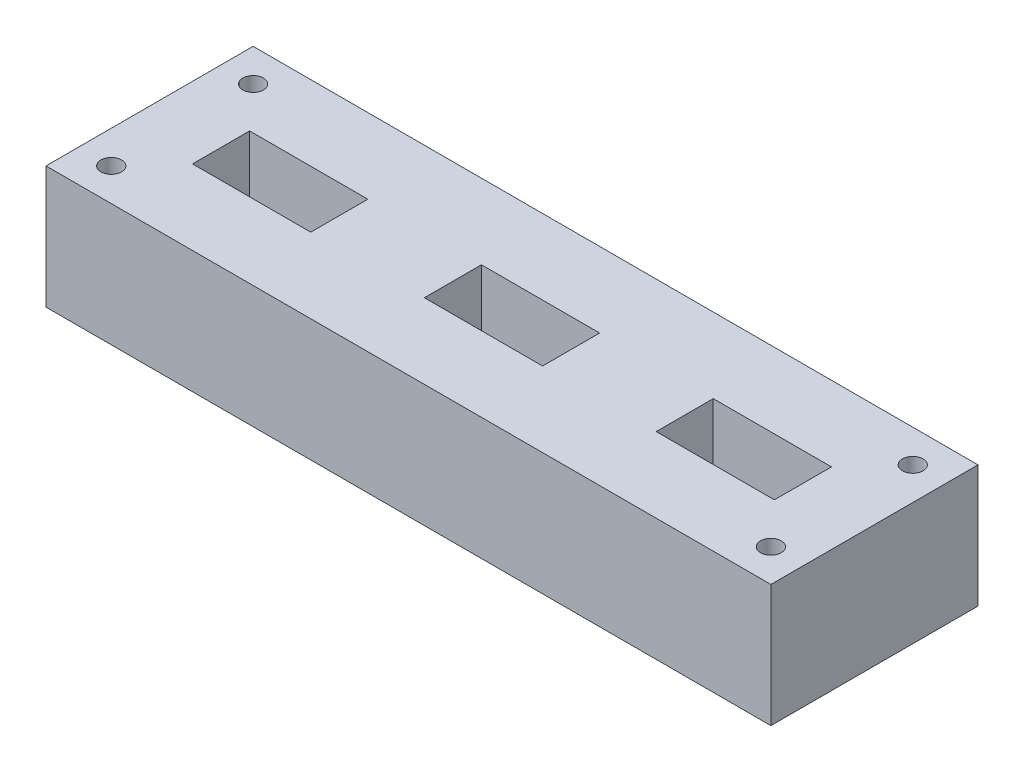
ISO-10303-21;
HEADER;
FILE_DESCRIPTION(('STEP AP214'),'2;1');
FILE_NAME('part.step','',(''),(''),'','','');
FILE_SCHEMA(('AUTOMOTIVE_DESIGN { 1 0 10303 214 1 1 1 1 }'));
ENDSEC;
DATA;
#1=APPLICATION_CONTEXT('core data for automotive mechanical design processes');
#2=APPLICATION_PROTOCOL_DEFINITION('international standard','automotive_design',2000,#1);
#3=PRODUCT_CONTEXT('',#1,'mechanical');
#4=PRODUCT('Part','Part','',(#3));
#5=PRODUCT_RELATED_PRODUCT_CATEGORY('part','',(#4));
#6=PRODUCT_DEFINITION_FORMATION('','',#4);
#7=PRODUCT_DEFINITION_CONTEXT('part definition',#1,'design');
#8=PRODUCT_DEFINITION('design','',#6,#7);
#9=PRODUCT_DEFINITION_SHAPE('','',#8);
#10=(LENGTH_UNIT() NAMED_UNIT(*) SI_UNIT(.MILLI.,.METRE.));
#11=(NAMED_UNIT(*) PLANE_ANGLE_UNIT() SI_UNIT($,.RADIAN.));
#12=(NAMED_UNIT(*) SI_UNIT($,.STERADIAN.) SOLID_ANGLE_UNIT());
#13=UNCERTAINTY_MEASURE_WITH_UNIT(LENGTH_MEASURE(1.E-05),#10,'distance_accuracy_value','');
#14=(GEOMETRIC_REPRESENTATION_CONTEXT(3) GLOBAL_UNCERTAINTY_ASSIGNED_CONTEXT((#13)) GLOBAL_UNIT_ASSIGNED_CONTEXT((#10,
#11,#12)) REPRESENTATION_CONTEXT('',''));
#15=CARTESIAN_POINT('',(0.,0.,0.));
#16=DIRECTION('',(0.,0.,1.));
#17=DIRECTION('',(1.,0.,0.));
#18=AXIS2_PLACEMENT_3D('',#15,#16,#17);
#19=CARTESIAN_POINT('',(-44.45,14.999999972,-12.7));
#20=DIRECTION('',(1.,0.,0.));
#21=DIRECTION('',(0.,0.,-1.));
#22=AXIS2_PLACEMENT_3D('',#19,#20,#21);
#23=PLANE('',#22);
#24=DIRECTION('',(0.,0.,1.));
#25=VECTOR('',#24,1.);
#26=CARTESIAN_POINT('',(-44.45,0.,-12.7));
#27=LINE('',#26,#25);
#28=CARTESIAN_POINT('',(-44.45,0.,-12.7));
#29=VERTEX_POINT('',#28);
#30=CARTESIAN_POINT('',(-44.45,0.,12.7));
#31=VERTEX_POINT('',#30);
#32=EDGE_CURVE('E211',#29,#31,#27,.T.);
#33=ORIENTED_EDGE('',*,*,#32,.T.);
#34=DIRECTION('',(0.,-1.,0.));
#35=VECTOR('',#34,1.);
#36=CARTESIAN_POINT('',(-44.45,14.999999972,12.7));
#37=LINE('',#36,#35);
#38=CARTESIAN_POINT('',(-44.45,14.999999972,12.7));
#39=VERTEX_POINT('',#38);
#40=EDGE_CURVE('E244',#39,#31,#37,.T.);
#41=ORIENTED_EDGE('',*,*,#40,.F.);
#42=DIRECTION('',(0.,0.,1.));
#43=VECTOR('',#42,1.);
#44=CARTESIAN_POINT('',(-44.45,14.999999972,-12.7));
#45=LINE('',#44,#43);
#46=CARTESIAN_POINT('',(-44.45,14.999999972,-12.7));
#47=VERTEX_POINT('',#46);
#48=EDGE_CURVE('E218',#47,#39,#45,.T.);
#49=ORIENTED_EDGE('',*,*,#48,.F.);
#50=DIRECTION('',(0.,-1.,0.));
#51=VECTOR('',#50,1.);
#52=CARTESIAN_POINT('',(-44.45,14.999999972,-12.7));
#53=LINE('',#52,#51);
#54=EDGE_CURVE('E228',#47,#29,#53,.T.);
#55=ORIENTED_EDGE('',*,*,#54,.T.);
#56=EDGE_LOOP('',(#33,#41,#49,#55));
#57=FACE_BOUND('',#56,.T.);
#58=ADVANCED_FACE('F37',(#57),#23,.F.);
#59=CARTESIAN_POINT('',(-44.45,14.999999972,12.7));
#60=DIRECTION('',(0.,0.,-1.));
#61=DIRECTION('',(-1.,0.,0.));
#62=AXIS2_PLACEMENT_3D('',#59,#60,#61);
#63=PLANE('',#62);
#64=DIRECTION('',(1.,0.,0.));
#65=VECTOR('',#64,1.);
#66=CARTESIAN_POINT('',(-44.45,0.,12.7));
#67=LINE('',#66,#65);
#68=CARTESIAN_POINT('',(44.45,0.,12.7));
#69=VERTEX_POINT('',#68);
#70=EDGE_CURVE('E231',#31,#69,#67,.T.);
#71=ORIENTED_EDGE('',*,*,#70,.T.);
#72=DIRECTION('',(0.,-1.,0.));
#73=VECTOR('',#72,1.);
#74=CARTESIAN_POINT('',(44.45,14.999999972,12.7));
#75=LINE('',#74,#73);
#76=CARTESIAN_POINT('',(44.45,14.999999972,12.7));
#77=VERTEX_POINT('',#76);
#78=EDGE_CURVE('E241',#77,#69,#75,.T.);
#79=ORIENTED_EDGE('',*,*,#78,.F.);
#80=DIRECTION('',(1.,0.,0.));
#81=VECTOR('',#80,1.);
#82=CARTESIAN_POINT('',(-44.45,14.999999972,12.7));
#83=LINE('',#82,#81);
#84=EDGE_CURVE('E221',#39,#77,#83,.T.);
#85=ORIENTED_EDGE('',*,*,#84,.F.);
#86=ORIENTED_EDGE('',*,*,#40,.T.);
#87=EDGE_LOOP('',(#71,#79,#85,#86));
#88=FACE_BOUND('',#87,.T.);
#89=ADVANCED_FACE('F305',(#88),#63,.F.);
#90=CARTESIAN_POINT('',(44.45,14.999999972,-12.7));
#91=DIRECTION('',(-1.,0.,0.));
#92=DIRECTION('',(0.,0.,1.));
#93=AXIS2_PLACEMENT_3D('',#90,#91,#92);
#94=PLANE('',#93);
#95=DIRECTION('',(0.,0.,-1.));
#96=VECTOR('',#95,1.);
#97=CARTESIAN_POINT('',(44.45,0.,-12.7));
#98=LINE('',#97,#96);
#99=CARTESIAN_POINT('',(44.45,0.,-12.7));
#100=VERTEX_POINT('',#99);
#101=EDGE_CURVE('E233',#69,#100,#98,.T.);
#102=ORIENTED_EDGE('',*,*,#101,.T.);
#103=DIRECTION('',(0.,-1.,0.));
#104=VECTOR('',#103,1.);
#105=CARTESIAN_POINT('',(44.45,14.999999972,-12.7));
#106=LINE('',#105,#104);
#107=CARTESIAN_POINT('',(44.45,14.999999972,-12.7));
#108=VERTEX_POINT('',#107);
#109=EDGE_CURVE('E238',#108,#100,#106,.T.);
#110=ORIENTED_EDGE('',*,*,#109,.F.);
#111=DIRECTION('',(0.,0.,-1.));
#112=VECTOR('',#111,1.);
#113=CARTESIAN_POINT('',(44.45,14.999999972,-12.7));
#114=LINE('',#113,#112);
#115=EDGE_CURVE('E224',#77,#108,#114,.T.);
#116=ORIENTED_EDGE('',*,*,#115,.F.);
#117=ORIENTED_EDGE('',*,*,#78,.T.);
#118=EDGE_LOOP('',(#102,#110,#116,#117));
#119=FACE_BOUND('',#118,.T.);
#120=ADVANCED_FACE('F310',(#119),#94,.F.);
#121=CARTESIAN_POINT('',(-44.45,14.999999972,-12.7));
#122=DIRECTION('',(0.,0.,1.));
#123=DIRECTION('',(1.,0.,0.));
#124=AXIS2_PLACEMENT_3D('',#121,#122,#123);
#125=PLANE('',#124);
#126=DIRECTION('',(-1.,0.,0.));
#127=VECTOR('',#126,1.);
#128=CARTESIAN_POINT('',(-44.45,0.,-12.7));
#129=LINE('',#128,#127);
#130=EDGE_CURVE('E222',#100,#29,#129,.T.);
#131=ORIENTED_EDGE('',*,*,#130,.T.);
#132=ORIENTED_EDGE('',*,*,#54,.F.);
#133=DIRECTION('',(-1.,0.,0.));
#134=VECTOR('',#133,1.);
#135=CARTESIAN_POINT('',(-44.45,14.999999972,-12.7));
#136=LINE('',#135,#134);
#137=EDGE_CURVE('E226',#108,#47,#136,.T.);
#138=ORIENTED_EDGE('',*,*,#137,.F.);
#139=ORIENTED_EDGE('',*,*,#109,.T.);
#140=EDGE_LOOP('',(#131,#132,#138,#139));
#141=FACE_BOUND('',#140,.T.);
#142=ADVANCED_FACE('F325',(#141),#125,.F.);
#143=CARTESIAN_POINT('',(0.,14.999999972,0.));
#144=DIRECTION('',(0.,1.,0.));
#145=DIRECTION('',(0.,0.,1.));
#146=AXIS2_PLACEMENT_3D('',#143,#144,#145);
#147=PLANE('',#146);
#148=CARTESIAN_POINT('',(40.45,14.999999972,-8.7));
#149=DIRECTION('',(0.,1.,0.));
#150=DIRECTION('',(0.,0.,1.));
#151=AXIS2_PLACEMENT_3D('',#148,#149,#150);
#152=CIRCLE('',#151,1.27);
#153=CARTESIAN_POINT('',(40.45,14.999999972,-7.43));
#154=VERTEX_POINT('',#153);
#155=EDGE_CURVE('E412',#154,#154,#152,.T.);
#156=ORIENTED_EDGE('',*,*,#155,.F.);
#157=EDGE_LOOP('',(#156));
#158=FACE_BOUND('',#157,.T.);
#159=CARTESIAN_POINT('',(-40.45,14.999999972,8.7));
#160=DIRECTION('',(0.,1.,0.));
#161=DIRECTION('',(0.,0.,1.));
#162=AXIS2_PLACEMENT_3D('',#159,#160,#161);
#163=CIRCLE('',#162,1.27);
#164=CARTESIAN_POINT('',(-40.45,14.999999972,9.97));
#165=VERTEX_POINT('',#164);
#166=EDGE_CURVE('E413',#165,#165,#163,.T.);
#167=ORIENTED_EDGE('',*,*,#166,.F.);
#168=EDGE_LOOP('',(#167));
#169=FACE_BOUND('',#168,.T.);
#170=CARTESIAN_POINT('',(40.45,14.999999972,8.7));
#171=DIRECTION('',(0.,1.,0.));
#172=DIRECTION('',(0.,0.,1.));
#173=AXIS2_PLACEMENT_3D('',#170,#171,#172);
#174=CIRCLE('',#173,1.27);
#175=CARTESIAN_POINT('',(40.45,14.999999972,9.97));
#176=VERTEX_POINT('',#175);
#177=EDGE_CURVE('E416',#176,#176,#174,.T.);
#178=ORIENTED_EDGE('',*,*,#177,.F.);
#179=EDGE_LOOP('',(#178));
#180=FACE_BOUND('',#179,.T.);
#181=CARTESIAN_POINT('',(-40.45,14.999999972,-8.7));
#182=DIRECTION('',(0.,1.,0.));
#183=DIRECTION('',(0.,0.,1.));
#184=AXIS2_PLACEMENT_3D('',#181,#182,#183);
#185=CIRCLE('',#184,1.27);
#186=CARTESIAN_POINT('',(-40.45,14.999999972,-7.43));
#187=VERTEX_POINT('',#186);
#188=EDGE_CURVE('E280',#187,#187,#185,.T.);
#189=ORIENTED_EDGE('',*,*,#188,.F.);
#190=EDGE_LOOP('',(#189));
#191=FACE_BOUND('',#190,.T.);
#192=DIRECTION('',(0.,0.,1.));
#193=VECTOR('',#192,1.);
#194=CARTESIAN_POINT('',(21.180000058,14.999999972,-3.499999985));
#195=LINE('',#194,#193);
#196=CARTESIAN_POINT('',(21.180000058,14.999999972,-3.499999985));
#197=VERTEX_POINT('',#196);
#198=CARTESIAN_POINT('',(21.180000058,14.999999972,3.499999985));
#199=VERTEX_POINT('',#198);
#200=EDGE_CURVE('E53',#197,#199,#195,.T.);
#201=ORIENTED_EDGE('',*,*,#200,.F.);
#202=DIRECTION('',(-1.,0.,0.));
#203=VECTOR('',#202,1.);
#204=CARTESIAN_POINT('',(21.180000058,14.999999972,-3.499999985));
#205=LINE('',#204,#203);
#206=CARTESIAN_POINT('',(35.680000014,14.999999972,-3.499999985));
#207=VERTEX_POINT('',#206);
#208=EDGE_CURVE('E184',#207,#197,#205,.T.);
#209=ORIENTED_EDGE('',*,*,#208,.F.);
#210=DIRECTION('',(0.,0.,-1.));
#211=VECTOR('',#210,1.);
#212=CARTESIAN_POINT('',(35.680000014,14.999999972,-3.499999985));
#213=LINE('',#212,#211);
#214=CARTESIAN_POINT('',(35.680000014,14.999999972,3.499999985));
#215=VERTEX_POINT('',#214);
#216=EDGE_CURVE('E193',#215,#207,#213,.T.);
#217=ORIENTED_EDGE('',*,*,#216,.F.);
#218=DIRECTION('',(1.,0.,0.));
#219=VECTOR('',#218,1.);
#220=CARTESIAN_POINT('',(21.180000058,14.999999972,3.499999985));
#221=LINE('',#220,#219);
#222=EDGE_CURVE('E196',#199,#215,#221,.T.);
#223=ORIENTED_EDGE('',*,*,#222,.F.);
#224=EDGE_LOOP('',(#201,#209,#217,#223));
#225=FACE_BOUND('',#224,.T.);
#226=DIRECTION('',(0.,0.,1.));
#227=VECTOR('',#226,1.);
#228=CARTESIAN_POINT('',(-35.680000014,14.999999972,-3.499999985));
#229=LINE('',#228,#227);
#230=CARTESIAN_POINT('',(-35.680000014,14.999999972,-3.499999985));
#231=VERTEX_POINT('',#230);
#232=CARTESIAN_POINT('',(-35.680000014,14.999999972,3.499999985));
#233=VERTEX_POINT('',#232);
#234=EDGE_CURVE('E61',#231,#233,#229,.T.);
#235=ORIENTED_EDGE('',*,*,#234,.F.);
#236=DIRECTION('',(-1.,0.,0.));
#237=VECTOR('',#236,1.);
#238=CARTESIAN_POINT('',(-35.680000014,14.999999972,-3.499999985));
#239=LINE('',#238,#237);
#240=CARTESIAN_POINT('',(-21.180000058,14.999999972,-3.499999985));
#241=VERTEX_POINT('',#240);
#242=EDGE_CURVE('E161',#241,#231,#239,.T.);
#243=ORIENTED_EDGE('',*,*,#242,.F.);
#244=DIRECTION('',(0.,0.,-1.));
#245=VECTOR('',#244,1.);
#246=CARTESIAN_POINT('',(-21.180000058,14.999999972,-3.499999985));
#247=LINE('',#246,#245);
#248=CARTESIAN_POINT('',(-21.180000058,14.999999972,3.499999985));
#249=VERTEX_POINT('',#248);
#250=EDGE_CURVE('E167',#249,#241,#247,.T.);
#251=ORIENTED_EDGE('',*,*,#250,.F.);
#252=DIRECTION('',(1.,0.,0.));
#253=VECTOR('',#252,1.);
#254=CARTESIAN_POINT('',(-35.680000014,14.999999972,3.499999985));
#255=LINE('',#254,#253);
#256=EDGE_CURVE('E174',#233,#249,#255,.T.);
#257=ORIENTED_EDGE('',*,*,#256,.F.);
#258=EDGE_LOOP('',(#235,#243,#251,#257));
#259=FACE_BOUND('',#258,.T.);
#260=DIRECTION('',(0.,0.,1.));
#261=VECTOR('',#260,1.);
#262=CARTESIAN_POINT('',(-7.249999978,14.999999972,-3.499999985));
#263=LINE('',#262,#261);
#264=CARTESIAN_POINT('',(-7.249999978,14.999999972,-3.499999985));
#265=VERTEX_POINT('',#264);
#266=CARTESIAN_POINT('',(-7.249999978,14.999999972,3.499999985));
#267=VERTEX_POINT('',#266);
#268=EDGE_CURVE('E175',#265,#267,#263,.T.);
#269=ORIENTED_EDGE('',*,*,#268,.F.);
#270=DIRECTION('',(-1.,0.,0.));
#271=VECTOR('',#270,1.);
#272=CARTESIAN_POINT('',(-7.249999978,14.999999972,-3.499999985));
#273=LINE('',#272,#271);
#274=CARTESIAN_POINT('',(7.249999978,14.999999972,-3.499999985));
#275=VERTEX_POINT('',#274);
#276=EDGE_CURVE('E205',#275,#265,#273,.T.);
#277=ORIENTED_EDGE('',*,*,#276,.F.);
#278=DIRECTION('',(0.,0.,-1.));
#279=VECTOR('',#278,1.);
#280=CARTESIAN_POINT('',(7.249999978,14.999999972,-3.499999985));
#281=LINE('',#280,#279);
#282=CARTESIAN_POINT('',(7.249999978,14.999999972,3.499999985));
#283=VERTEX_POINT('',#282);
#284=EDGE_CURVE('E202',#283,#275,#281,.T.);
#285=ORIENTED_EDGE('',*,*,#284,.F.);
#286=DIRECTION('',(1.,0.,0.));
#287=VECTOR('',#286,1.);
#288=CARTESIAN_POINT('',(-7.249999978,14.999999972,3.499999985));
#289=LINE('',#288,#287);
#290=EDGE_CURVE('E177',#267,#283,#289,.T.);
#291=ORIENTED_EDGE('',*,*,#290,.F.);
#292=EDGE_LOOP('',(#269,#277,#285,#291));
#293=FACE_BOUND('',#292,.T.);
#294=ORIENTED_EDGE('',*,*,#48,.T.);
#295=ORIENTED_EDGE('',*,*,#84,.T.);
#296=ORIENTED_EDGE('',*,*,#115,.T.);
#297=ORIENTED_EDGE('',*,*,#137,.T.);
#298=EDGE_LOOP('',(#294,#295,#296,#297));
#299=FACE_BOUND('',#298,.T.);
#300=ADVANCED_FACE('F171',(#158,#169,#180,#191,#225,#259,#293,#299),#147,.T.);
#301=CARTESIAN_POINT('',(0.,0.,0.));
#302=DIRECTION('',(0.,1.,0.));
#303=DIRECTION('',(0.,0.,1.));
#304=AXIS2_PLACEMENT_3D('',#301,#302,#303);
#305=PLANE('',#304);
#306=CARTESIAN_POINT('',(40.45,0.,-8.7));
#307=DIRECTION('',(0.,1.,0.));
#308=DIRECTION('',(0.,0.,1.));
#309=AXIS2_PLACEMENT_3D('',#306,#307,#308);
#310=CIRCLE('',#309,1.27);
#311=CARTESIAN_POINT('',(40.45,0.,-7.43));
#312=VERTEX_POINT('',#311);
#313=EDGE_CURVE('E40',#312,#312,#310,.T.);
#314=ORIENTED_EDGE('',*,*,#313,.T.);
#315=EDGE_LOOP('',(#314));
#316=FACE_BOUND('',#315,.T.);
#317=CARTESIAN_POINT('',(-40.45,0.,8.7));
#318=DIRECTION('',(0.,1.,0.));
#319=DIRECTION('',(0.,0.,1.));
#320=AXIS2_PLACEMENT_3D('',#317,#318,#319);
#321=CIRCLE('',#320,1.27);
#322=CARTESIAN_POINT('',(-40.45,0.,9.97));
#323=VERTEX_POINT('',#322);
#324=EDGE_CURVE('E282',#323,#323,#321,.T.);
#325=ORIENTED_EDGE('',*,*,#324,.T.);
#326=EDGE_LOOP('',(#325));
#327=FACE_BOUND('',#326,.T.);
#328=CARTESIAN_POINT('',(40.45,0.,8.7));
#329=DIRECTION('',(0.,1.,0.));
#330=DIRECTION('',(0.,0.,1.));
#331=AXIS2_PLACEMENT_3D('',#328,#329,#330);
#332=CIRCLE('',#331,1.27);
#333=CARTESIAN_POINT('',(40.45,0.,9.97));
#334=VERTEX_POINT('',#333);
#335=EDGE_CURVE('E279',#334,#334,#332,.T.);
#336=ORIENTED_EDGE('',*,*,#335,.T.);
#337=EDGE_LOOP('',(#336));
#338=FACE_BOUND('',#337,.T.);
#339=CARTESIAN_POINT('',(-40.45,0.,-8.7));
#340=DIRECTION('',(0.,1.,0.));
#341=DIRECTION('',(0.,0.,1.));
#342=AXIS2_PLACEMENT_3D('',#339,#340,#341);
#343=CIRCLE('',#342,1.27);
#344=CARTESIAN_POINT('',(-40.45,0.,-7.43));
#345=VERTEX_POINT('',#344);
#346=EDGE_CURVE('E276',#345,#345,#343,.T.);
#347=ORIENTED_EDGE('',*,*,#346,.T.);
#348=EDGE_LOOP('',(#347));
#349=FACE_BOUND('',#348,.T.);
#350=DIRECTION('',(-1.,0.,0.));
#351=VECTOR('',#350,1.);
#352=CARTESIAN_POINT('',(0.,0.,-3.499999985));
#353=LINE('',#352,#351);
#354=CARTESIAN_POINT('',(35.680000014,0.,-3.499999985));
#355=VERTEX_POINT('',#354);
#356=CARTESIAN_POINT('',(21.180000058,0.,-3.499999985));
#357=VERTEX_POINT('',#356);
#358=EDGE_CURVE('E45',#355,#357,#353,.T.);
#359=ORIENTED_EDGE('',*,*,#358,.T.);
#360=DIRECTION('',(0.,0.,1.));
#361=VECTOR('',#360,1.);
#362=CARTESIAN_POINT('',(21.180000058,0.,0.));
#363=LINE('',#362,#361);
#364=CARTESIAN_POINT('',(21.180000058,0.,3.499999985));
#365=VERTEX_POINT('',#364);
#366=EDGE_CURVE('E11',#357,#365,#363,.T.);
#367=ORIENTED_EDGE('',*,*,#366,.T.);
#368=DIRECTION('',(1.,0.,0.));
#369=VECTOR('',#368,1.);
#370=CARTESIAN_POINT('',(0.,0.,3.499999985));
#371=LINE('',#370,#369);
#372=CARTESIAN_POINT('',(35.680000014,0.,3.499999985));
#373=VERTEX_POINT('',#372);
#374=EDGE_CURVE('E268',#365,#373,#371,.T.);
#375=ORIENTED_EDGE('',*,*,#374,.T.);
#376=DIRECTION('',(0.,0.,-1.));
#377=VECTOR('',#376,1.);
#378=CARTESIAN_POINT('',(35.680000014,0.,0.));
#379=LINE('',#378,#377);
#380=EDGE_CURVE('E271',#373,#355,#379,.T.);
#381=ORIENTED_EDGE('',*,*,#380,.T.);
#382=EDGE_LOOP('',(#359,#367,#375,#381));
#383=FACE_BOUND('',#382,.T.);
#384=DIRECTION('',(-1.,0.,0.));
#385=VECTOR('',#384,1.);
#386=CARTESIAN_POINT('',(0.,0.,-3.499999985));
#387=LINE('',#386,#385);
#388=CARTESIAN_POINT('',(-21.180000058,0.,-3.499999985));
#389=VERTEX_POINT('',#388);
#390=CARTESIAN_POINT('',(-35.680000014,0.,-3.499999985));
#391=VERTEX_POINT('',#390);
#392=EDGE_CURVE('E265',#389,#391,#387,.T.);
#393=ORIENTED_EDGE('',*,*,#392,.T.);
#394=DIRECTION('',(0.,0.,1.));
#395=VECTOR('',#394,1.);
#396=CARTESIAN_POINT('',(-35.680000014,0.,0.));
#397=LINE('',#396,#395);
#398=CARTESIAN_POINT('',(-35.680000014,0.,3.499999985));
#399=VERTEX_POINT('',#398);
#400=EDGE_CURVE('E155',#391,#399,#397,.T.);
#401=ORIENTED_EDGE('',*,*,#400,.T.);
#402=DIRECTION('',(1.,0.,0.));
#403=VECTOR('',#402,1.);
#404=CARTESIAN_POINT('',(0.,0.,3.499999985));
#405=LINE('',#404,#403);
#406=CARTESIAN_POINT('',(-21.180000058,0.,3.499999985));
#407=VERTEX_POINT('',#406);
#408=EDGE_CURVE('E259',#399,#407,#405,.T.);
#409=ORIENTED_EDGE('',*,*,#408,.T.);
#410=DIRECTION('',(0.,0.,-1.));
#411=VECTOR('',#410,1.);
#412=CARTESIAN_POINT('',(-21.180000058,0.,0.));
#413=LINE('',#412,#411);
#414=EDGE_CURVE('E262',#407,#389,#413,.T.);
#415=ORIENTED_EDGE('',*,*,#414,.T.);
#416=EDGE_LOOP('',(#393,#401,#409,#415));
#417=FACE_BOUND('',#416,.T.);
#418=DIRECTION('',(-1.,0.,0.));
#419=VECTOR('',#418,1.);
#420=CARTESIAN_POINT('',(0.,0.,-3.499999985));
#421=LINE('',#420,#419);
#422=CARTESIAN_POINT('',(7.249999978,0.,-3.499999985));
#423=VERTEX_POINT('',#422);
#424=CARTESIAN_POINT('',(-7.249999978,0.,-3.499999985));
#425=VERTEX_POINT('',#424);
#426=EDGE_CURVE('E253',#423,#425,#421,.T.);
#427=ORIENTED_EDGE('',*,*,#426,.T.);
#428=DIRECTION('',(0.,0.,1.));
#429=VECTOR('',#428,1.);
#430=CARTESIAN_POINT('',(-7.249999978,0.,0.));
#431=LINE('',#430,#429);
#432=CARTESIAN_POINT('',(-7.249999978,0.,3.499999985));
#433=VERTEX_POINT('',#432);
#434=EDGE_CURVE('E256',#425,#433,#431,.T.);
#435=ORIENTED_EDGE('',*,*,#434,.T.);
#436=DIRECTION('',(1.,0.,0.));
#437=VECTOR('',#436,1.);
#438=CARTESIAN_POINT('',(0.,0.,3.499999985));
#439=LINE('',#438,#437);
#440=CARTESIAN_POINT('',(7.249999978,0.,3.499999985));
#441=VERTEX_POINT('',#440);
#442=EDGE_CURVE('E247',#433,#441,#439,.T.);
#443=ORIENTED_EDGE('',*,*,#442,.T.);
#444=DIRECTION('',(0.,0.,-1.));
#445=VECTOR('',#444,1.);
#446=CARTESIAN_POINT('',(7.249999978,0.,0.));
#447=LINE('',#446,#445);
#448=EDGE_CURVE('E250',#441,#423,#447,.T.);
#449=ORIENTED_EDGE('',*,*,#448,.T.);
#450=EDGE_LOOP('',(#427,#435,#443,#449));
#451=FACE_BOUND('',#450,.T.);
#452=ORIENTED_EDGE('',*,*,#32,.F.);
#453=ORIENTED_EDGE('',*,*,#130,.F.);
#454=ORIENTED_EDGE('',*,*,#101,.F.);
#455=ORIENTED_EDGE('',*,*,#70,.F.);
#456=EDGE_LOOP('',(#452,#453,#454,#455));
#457=FACE_BOUND('',#456,.T.);
#458=ADVANCED_FACE('F289',(#316,#327,#338,#349,#383,#417,#451,#457),#305,.F.);
#459=CARTESIAN_POINT('',(-7.249999978,-10.400000028,-3.499999985));
#460=DIRECTION('',(-1.,0.,0.));
#461=DIRECTION('',(0.,0.,1.));
#462=AXIS2_PLACEMENT_3D('',#459,#460,#461);
#463=PLANE('',#462);
#464=DIRECTION('',(0.,1.,0.));
#465=VECTOR('',#464,1.);
#466=CARTESIAN_POINT('',(-7.249999978,-10.400000028,-3.499999985));
#467=LINE('',#466,#465);
#468=EDGE_CURVE('E209',#425,#265,#467,.T.);
#469=ORIENTED_EDGE('',*,*,#468,.T.);
#470=ORIENTED_EDGE('',*,*,#268,.T.);
#471=DIRECTION('',(0.,1.,0.));
#472=VECTOR('',#471,1.);
#473=CARTESIAN_POINT('',(-7.249999978,-10.400000028,3.499999985));
#474=LINE('',#473,#472);
#475=EDGE_CURVE('E208',#433,#267,#474,.T.);
#476=ORIENTED_EDGE('',*,*,#475,.F.);
#477=ORIENTED_EDGE('',*,*,#434,.F.);
#478=EDGE_LOOP('',(#469,#470,#476,#477));
#479=FACE_BOUND('',#478,.T.);
#480=ADVANCED_FACE('F336',(#479),#463,.F.);
#481=CARTESIAN_POINT('',(-7.249999978,-10.400000028,-3.499999985));
#482=DIRECTION('',(0.,0.,-1.));
#483=DIRECTION('',(-1.,0.,0.));
#484=AXIS2_PLACEMENT_3D('',#481,#482,#483);
#485=PLANE('',#484);
#486=DIRECTION('',(0.,1.,0.));
#487=VECTOR('',#486,1.);
#488=CARTESIAN_POINT('',(7.249999978,-10.400000028,-3.499999985));
#489=LINE('',#488,#487);
#490=EDGE_CURVE('E212',#423,#275,#489,.T.);
#491=ORIENTED_EDGE('',*,*,#490,.T.);
#492=ORIENTED_EDGE('',*,*,#276,.T.);
#493=ORIENTED_EDGE('',*,*,#468,.F.);
#494=ORIENTED_EDGE('',*,*,#426,.F.);
#495=EDGE_LOOP('',(#491,#492,#493,#494));
#496=FACE_BOUND('',#495,.T.);
#497=ADVANCED_FACE('F342',(#496),#485,.F.);
#498=CARTESIAN_POINT('',(7.249999978,-10.400000028,-3.499999985));
#499=DIRECTION('',(1.,0.,0.));
#500=DIRECTION('',(0.,0.,-1.));
#501=AXIS2_PLACEMENT_3D('',#498,#499,#500);
#502=PLANE('',#501);
#503=DIRECTION('',(0.,1.,0.));
#504=VECTOR('',#503,1.);
#505=CARTESIAN_POINT('',(7.249999978,-10.400000028,3.499999985));
#506=LINE('',#505,#504);
#507=EDGE_CURVE('E214',#441,#283,#506,.T.);
#508=ORIENTED_EDGE('',*,*,#507,.T.);
#509=ORIENTED_EDGE('',*,*,#284,.T.);
#510=ORIENTED_EDGE('',*,*,#490,.F.);
#511=ORIENTED_EDGE('',*,*,#448,.F.);
#512=EDGE_LOOP('',(#508,#509,#510,#511));
#513=FACE_BOUND('',#512,.T.);
#514=ADVANCED_FACE('F347',(#513),#502,.F.);
#515=CARTESIAN_POINT('',(-7.249999978,-10.400000028,3.499999985));
#516=DIRECTION('',(0.,0.,1.));
#517=DIRECTION('',(1.,0.,0.));
#518=AXIS2_PLACEMENT_3D('',#515,#516,#517);
#519=PLANE('',#518);
#520=ORIENTED_EDGE('',*,*,#475,.T.);
#521=ORIENTED_EDGE('',*,*,#290,.T.);
#522=ORIENTED_EDGE('',*,*,#507,.F.);
#523=ORIENTED_EDGE('',*,*,#442,.F.);
#524=EDGE_LOOP('',(#520,#521,#522,#523));
#525=FACE_BOUND('',#524,.T.);
#526=ADVANCED_FACE('F344',(#525),#519,.F.);
#527=CARTESIAN_POINT('',(-35.680000014,-10.400000028,-3.499999985));
#528=DIRECTION('',(-1.,0.,0.));
#529=DIRECTION('',(0.,0.,1.));
#530=AXIS2_PLACEMENT_3D('',#527,#528,#529);
#531=PLANE('',#530);
#532=DIRECTION('',(0.,1.,0.));
#533=VECTOR('',#532,1.);
#534=CARTESIAN_POINT('',(-35.680000014,-10.400000028,-3.499999985));
#535=LINE('',#534,#533);
#536=EDGE_CURVE('E151',#391,#231,#535,.T.);
#537=ORIENTED_EDGE('',*,*,#536,.T.);
#538=ORIENTED_EDGE('',*,*,#234,.T.);
#539=DIRECTION('',(0.,1.,0.));
#540=VECTOR('',#539,1.);
#541=CARTESIAN_POINT('',(-35.680000014,-10.400000028,3.499999985));
#542=LINE('',#541,#540);
#543=EDGE_CURVE('E168',#399,#233,#542,.T.);
#544=ORIENTED_EDGE('',*,*,#543,.F.);
#545=ORIENTED_EDGE('',*,*,#400,.F.);
#546=EDGE_LOOP('',(#537,#538,#544,#545));
#547=FACE_BOUND('',#546,.T.);
#548=ADVANCED_FACE('F153',(#547),#531,.F.);
#549=CARTESIAN_POINT('',(-35.680000014,-10.400000028,-3.499999985));
#550=DIRECTION('',(0.,0.,-1.));
#551=DIRECTION('',(-1.,0.,0.));
#552=AXIS2_PLACEMENT_3D('',#549,#550,#551);
#553=PLANE('',#552);
#554=DIRECTION('',(0.,1.,0.));
#555=VECTOR('',#554,1.);
#556=CARTESIAN_POINT('',(-21.180000058,-10.400000028,-3.499999985));
#557=LINE('',#556,#555);
#558=EDGE_CURVE('E158',#389,#241,#557,.T.);
#559=ORIENTED_EDGE('',*,*,#558,.T.);
#560=ORIENTED_EDGE('',*,*,#242,.T.);
#561=ORIENTED_EDGE('',*,*,#536,.F.);
#562=ORIENTED_EDGE('',*,*,#392,.F.);
#563=EDGE_LOOP('',(#559,#560,#561,#562));
#564=FACE_BOUND('',#563,.T.);
#565=ADVANCED_FACE('F162',(#564),#553,.F.);
#566=CARTESIAN_POINT('',(-21.180000058,-10.400000028,-3.499999985));
#567=DIRECTION('',(1.,0.,0.));
#568=DIRECTION('',(0.,0.,-1.));
#569=AXIS2_PLACEMENT_3D('',#566,#567,#568);
#570=PLANE('',#569);
#571=DIRECTION('',(0.,1.,0.));
#572=VECTOR('',#571,1.);
#573=CARTESIAN_POINT('',(-21.180000058,-10.400000028,3.499999985));
#574=LINE('',#573,#572);
#575=EDGE_CURVE('E406',#407,#249,#574,.T.);
#576=ORIENTED_EDGE('',*,*,#575,.T.);
#577=ORIENTED_EDGE('',*,*,#250,.T.);
#578=ORIENTED_EDGE('',*,*,#558,.F.);
#579=ORIENTED_EDGE('',*,*,#414,.F.);
#580=EDGE_LOOP('',(#576,#577,#578,#579));
#581=FACE_BOUND('',#580,.T.);
#582=ADVANCED_FACE('F374',(#581),#570,.F.);
#583=CARTESIAN_POINT('',(-35.680000014,-10.400000028,3.499999985));
#584=DIRECTION('',(0.,0.,1.));
#585=DIRECTION('',(1.,0.,0.));
#586=AXIS2_PLACEMENT_3D('',#583,#584,#585);
#587=PLANE('',#586);
#588=ORIENTED_EDGE('',*,*,#543,.T.);
#589=ORIENTED_EDGE('',*,*,#256,.T.);
#590=ORIENTED_EDGE('',*,*,#575,.F.);
#591=ORIENTED_EDGE('',*,*,#408,.F.);
#592=EDGE_LOOP('',(#588,#589,#590,#591));
#593=FACE_BOUND('',#592,.T.);
#594=ADVANCED_FACE('F371',(#593),#587,.F.);
#595=CARTESIAN_POINT('',(21.180000058,-10.400000028,-3.499999985));
#596=DIRECTION('',(-1.,0.,0.));
#597=DIRECTION('',(0.,0.,1.));
#598=AXIS2_PLACEMENT_3D('',#595,#596,#597);
#599=PLANE('',#598);
#600=DIRECTION('',(0.,1.,0.));
#601=VECTOR('',#600,1.);
#602=CARTESIAN_POINT('',(21.180000058,-10.400000028,-3.499999985));
#603=LINE('',#602,#601);
#604=EDGE_CURVE('E189',#357,#197,#603,.T.);
#605=ORIENTED_EDGE('',*,*,#604,.T.);
#606=ORIENTED_EDGE('',*,*,#200,.T.);
#607=DIRECTION('',(0.,1.,0.));
#608=VECTOR('',#607,1.);
#609=CARTESIAN_POINT('',(21.180000058,-10.400000028,3.499999985));
#610=LINE('',#609,#608);
#611=EDGE_CURVE('E182',#365,#199,#610,.T.);
#612=ORIENTED_EDGE('',*,*,#611,.F.);
#613=ORIENTED_EDGE('',*,*,#366,.F.);
#614=EDGE_LOOP('',(#605,#606,#612,#613));
#615=FACE_BOUND('',#614,.T.);
#616=ADVANCED_FACE('F359',(#615),#599,.F.);
#617=CARTESIAN_POINT('',(21.180000058,-10.400000028,-3.499999985));
#618=DIRECTION('',(0.,0.,-1.));
#619=DIRECTION('',(-1.,0.,0.));
#620=AXIS2_PLACEMENT_3D('',#617,#618,#619);
#621=PLANE('',#620);
#622=DIRECTION('',(0.,1.,0.));
#623=VECTOR('',#622,1.);
#624=CARTESIAN_POINT('',(35.680000014,-10.400000028,-3.499999985));
#625=LINE('',#624,#623);
#626=EDGE_CURVE('E187',#355,#207,#625,.T.);
#627=ORIENTED_EDGE('',*,*,#626,.T.);
#628=ORIENTED_EDGE('',*,*,#208,.T.);
#629=ORIENTED_EDGE('',*,*,#604,.F.);
#630=ORIENTED_EDGE('',*,*,#358,.F.);
#631=EDGE_LOOP('',(#627,#628,#629,#630));
#632=FACE_BOUND('',#631,.T.);
#633=ADVANCED_FACE('F355',(#632),#621,.F.);
#634=CARTESIAN_POINT('',(35.680000014,-10.400000028,-3.499999985));
#635=DIRECTION('',(1.,0.,0.));
#636=DIRECTION('',(0.,0.,-1.));
#637=AXIS2_PLACEMENT_3D('',#634,#635,#636);
#638=PLANE('',#637);
#639=DIRECTION('',(0.,1.,0.));
#640=VECTOR('',#639,1.);
#641=CARTESIAN_POINT('',(35.680000014,-10.400000028,3.499999985));
#642=LINE('',#641,#640);
#643=EDGE_CURVE('E185',#373,#215,#642,.T.);
#644=ORIENTED_EDGE('',*,*,#643,.T.);
#645=ORIENTED_EDGE('',*,*,#216,.T.);
#646=ORIENTED_EDGE('',*,*,#626,.F.);
#647=ORIENTED_EDGE('',*,*,#380,.F.);
#648=EDGE_LOOP('',(#644,#645,#646,#647));
#649=FACE_BOUND('',#648,.T.);
#650=ADVANCED_FACE('F358',(#649),#638,.F.);
#651=CARTESIAN_POINT('',(21.180000058,-10.400000028,3.499999985));
#652=DIRECTION('',(0.,0.,1.));
#653=DIRECTION('',(1.,0.,0.));
#654=AXIS2_PLACEMENT_3D('',#651,#652,#653);
#655=PLANE('',#654);
#656=ORIENTED_EDGE('',*,*,#611,.T.);
#657=ORIENTED_EDGE('',*,*,#222,.T.);
#658=ORIENTED_EDGE('',*,*,#643,.F.);
#659=ORIENTED_EDGE('',*,*,#374,.F.);
#660=EDGE_LOOP('',(#656,#657,#658,#659));
#661=FACE_BOUND('',#660,.T.);
#662=ADVANCED_FACE('F363',(#661),#655,.F.);
#663=CARTESIAN_POINT('',(-40.45,-10.400000028,-8.7));
#664=DIRECTION('',(0.,1.,0.));
#665=DIRECTION('',(0.,0.,1.));
#666=AXIS2_PLACEMENT_3D('',#663,#664,#665);
#667=CYLINDRICAL_SURFACE('',#666,1.27);
#668=ORIENTED_EDGE('',*,*,#188,.T.);
#669=EDGE_LOOP('',(#668));
#670=FACE_BOUND('',#669,.T.);
#671=ORIENTED_EDGE('',*,*,#346,.F.);
#672=EDGE_LOOP('',(#671));
#673=FACE_BOUND('',#672,.T.);
#674=ADVANCED_FACE('F367',(#670,#673),#667,.F.);
#675=CARTESIAN_POINT('',(40.45,-10.400000028,8.7));
#676=DIRECTION('',(0.,1.,0.));
#677=DIRECTION('',(0.,0.,1.));
#678=AXIS2_PLACEMENT_3D('',#675,#676,#677);
#679=CYLINDRICAL_SURFACE('',#678,1.27);
#680=ORIENTED_EDGE('',*,*,#177,.T.);
#681=EDGE_LOOP('',(#680));
#682=FACE_BOUND('',#681,.T.);
#683=ORIENTED_EDGE('',*,*,#335,.F.);
#684=EDGE_LOOP('',(#683));
#685=FACE_BOUND('',#684,.T.);
#686=ADVANCED_FACE('F299',(#682,#685),#679,.F.);
#687=CARTESIAN_POINT('',(-40.45,-10.400000028,8.7));
#688=DIRECTION('',(0.,1.,0.));
#689=DIRECTION('',(0.,0.,1.));
#690=AXIS2_PLACEMENT_3D('',#687,#688,#689);
#691=CYLINDRICAL_SURFACE('',#690,1.27);
#692=ORIENTED_EDGE('',*,*,#166,.T.);
#693=EDGE_LOOP('',(#692));
#694=FACE_BOUND('',#693,.T.);
#695=ORIENTED_EDGE('',*,*,#324,.F.);
#696=EDGE_LOOP('',(#695));
#697=FACE_BOUND('',#696,.T.);
#698=ADVANCED_FACE('F293',(#694,#697),#691,.F.);
#699=CARTESIAN_POINT('',(40.45,-10.400000028,-8.7));
#700=DIRECTION('',(0.,1.,0.));
#701=DIRECTION('',(0.,0.,1.));
#702=AXIS2_PLACEMENT_3D('',#699,#700,#701);
#703=CYLINDRICAL_SURFACE('',#702,1.27);
#704=ORIENTED_EDGE('',*,*,#155,.T.);
#705=EDGE_LOOP('',(#704));
#706=FACE_BOUND('',#705,.T.);
#707=ORIENTED_EDGE('',*,*,#313,.F.);
#708=EDGE_LOOP('',(#707));
#709=FACE_BOUND('',#708,.T.);
#710=ADVANCED_FACE('F291',(#706,#709),#703,.F.);
#711=CLOSED_SHELL('',(#58,#89,#120,#142,#300,#458,#480,#497,#514,#526,#548,#565,#582,#594,#616,
#633,#650,#662,#674,#686,#698,#710));
#712=MANIFOLD_SOLID_BREP('B2',#711);
#713=ADVANCED_BREP_SHAPE_REPRESENTATION('',(#18,#712),#14);
#714=SHAPE_DEFINITION_REPRESENTATION(#9,#713);
ENDSEC;
END-ISO-10303-21;
